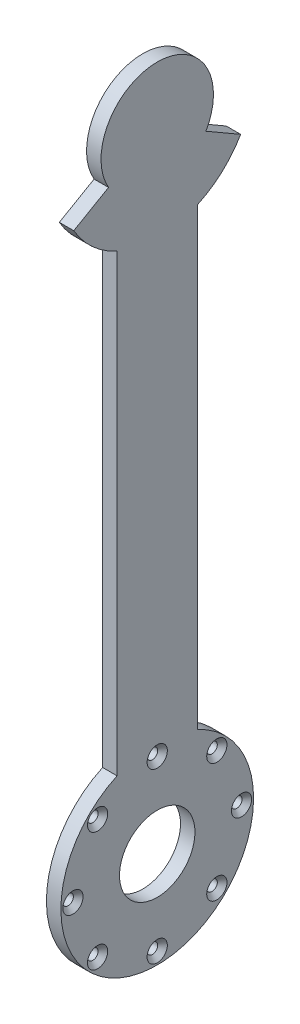
ISO-10303-21;
HEADER;
FILE_DESCRIPTION(('STEP AP214'),'2;1');
FILE_NAME('part.step','',(''),(''),'','','');
FILE_SCHEMA(('AUTOMOTIVE_DESIGN { 1 0 10303 214 1 1 1 1 }'));
ENDSEC;
DATA;
#1=APPLICATION_CONTEXT('core data for automotive mechanical design processes');
#2=APPLICATION_PROTOCOL_DEFINITION('international standard','automotive_design',2000,#1);
#3=PRODUCT_CONTEXT('',#1,'mechanical');
#4=PRODUCT('Part','Part','',(#3));
#5=PRODUCT_RELATED_PRODUCT_CATEGORY('part','',(#4));
#6=PRODUCT_DEFINITION_FORMATION('','',#4);
#7=PRODUCT_DEFINITION_CONTEXT('part definition',#1,'design');
#8=PRODUCT_DEFINITION('design','',#6,#7);
#9=PRODUCT_DEFINITION_SHAPE('','',#8);
#10=(LENGTH_UNIT() NAMED_UNIT(*) SI_UNIT(.MILLI.,.METRE.));
#11=(NAMED_UNIT(*) PLANE_ANGLE_UNIT() SI_UNIT($,.RADIAN.));
#12=(NAMED_UNIT(*) SI_UNIT($,.STERADIAN.) SOLID_ANGLE_UNIT());
#13=UNCERTAINTY_MEASURE_WITH_UNIT(LENGTH_MEASURE(1.E-05),#10,'distance_accuracy_value','');
#14=(GEOMETRIC_REPRESENTATION_CONTEXT(3) GLOBAL_UNCERTAINTY_ASSIGNED_CONTEXT((#13)) GLOBAL_UNIT_ASSIGNED_CONTEXT((#10,
#11,#12)) REPRESENTATION_CONTEXT('',''));
#15=CARTESIAN_POINT('',(0.,0.,0.));
#16=DIRECTION('',(0.,0.,1.));
#17=DIRECTION('',(1.,0.,0.));
#18=AXIS2_PLACEMENT_3D('',#15,#16,#17);
#19=CARTESIAN_POINT('',(9.,196.,0.));
#20=DIRECTION('',(1.,0.,0.));
#21=DIRECTION('',(0.,0.,-1.));
#22=AXIS2_PLACEMENT_3D('',#19,#20,#21);
#23=PLANE('',#22);
#24=CARTESIAN_POINT('',(9.,-143.5,0.));
#25=DIRECTION('',(1.,0.,0.));
#26=DIRECTION('',(0.,0.,-1.));
#27=AXIS2_PLACEMENT_3D('',#24,#25,#26);
#28=CIRCLE('',#27,6.3);
#29=CARTESIAN_POINT('',(9.,-143.5,-6.3));
#30=VERTEX_POINT('',#29);
#31=EDGE_CURVE('E430',#30,#30,#28,.T.);
#32=ORIENTED_EDGE('',*,*,#31,.F.);
#33=EDGE_LOOP('',(#32));
#34=FACE_BOUND('',#33,.T.);
#35=CARTESIAN_POINT('',(9.,-158.876893987705,-37.1231060122945));
#36=DIRECTION('',(1.,0.,0.));
#37=DIRECTION('',(0.,0.,-1.));
#38=AXIS2_PLACEMENT_3D('',#35,#36,#37);
#39=CIRCLE('',#38,6.3);
#40=CARTESIAN_POINT('',(9.,-158.876893987705,-43.4231060122945));
#41=VERTEX_POINT('',#40);
#42=EDGE_CURVE('E412',#41,#41,#39,.T.);
#43=ORIENTED_EDGE('',*,*,#42,.F.);
#44=EDGE_LOOP('',(#43));
#45=FACE_BOUND('',#44,.T.);
#46=CARTESIAN_POINT('',(9.,-196.,-52.5));
#47=DIRECTION('',(1.,0.,0.));
#48=DIRECTION('',(0.,0.,-1.));
#49=AXIS2_PLACEMENT_3D('',#46,#47,#48);
#50=CIRCLE('',#49,6.3);
#51=CARTESIAN_POINT('',(9.,-196.,-58.8));
#52=VERTEX_POINT('',#51);
#53=EDGE_CURVE('E394',#52,#52,#50,.T.);
#54=ORIENTED_EDGE('',*,*,#53,.F.);
#55=EDGE_LOOP('',(#54));
#56=FACE_BOUND('',#55,.T.);
#57=CARTESIAN_POINT('',(9.,-233.123106012294,-37.1231060122938));
#58=DIRECTION('',(1.,0.,0.));
#59=DIRECTION('',(0.,0.,-1.));
#60=AXIS2_PLACEMENT_3D('',#57,#58,#59);
#61=CIRCLE('',#60,6.3);
#62=CARTESIAN_POINT('',(9.,-233.123106012294,-43.4231060122938));
#63=VERTEX_POINT('',#62);
#64=EDGE_CURVE('E376',#63,#63,#61,.T.);
#65=ORIENTED_EDGE('',*,*,#64,.F.);
#66=EDGE_LOOP('',(#65));
#67=FACE_BOUND('',#66,.T.);
#68=CARTESIAN_POINT('',(9.,-248.5,0.));
#69=DIRECTION('',(1.,0.,0.));
#70=DIRECTION('',(0.,0.,-1.));
#71=AXIS2_PLACEMENT_3D('',#68,#69,#70);
#72=CIRCLE('',#71,6.3);
#73=CARTESIAN_POINT('',(9.,-248.5,-6.30000000000006));
#74=VERTEX_POINT('',#73);
#75=EDGE_CURVE('E358',#74,#74,#72,.T.);
#76=ORIENTED_EDGE('',*,*,#75,.F.);
#77=EDGE_LOOP('',(#76));
#78=FACE_BOUND('',#77,.T.);
#79=CARTESIAN_POINT('',(9.,-233.123106012294,37.1231060122937));
#80=DIRECTION('',(1.,0.,0.));
#81=DIRECTION('',(0.,0.,-1.));
#82=AXIS2_PLACEMENT_3D('',#79,#80,#81);
#83=CIRCLE('',#82,6.3);
#84=CARTESIAN_POINT('',(9.,-233.123106012294,30.8231060122937));
#85=VERTEX_POINT('',#84);
#86=EDGE_CURVE('E341',#85,#85,#83,.T.);
#87=ORIENTED_EDGE('',*,*,#86,.F.);
#88=EDGE_LOOP('',(#87));
#89=FACE_BOUND('',#88,.T.);
#90=CARTESIAN_POINT('',(9.,-196.000000000002,52.4999999999978));
#91=DIRECTION('',(1.,0.,0.));
#92=DIRECTION('',(0.,0.,-1.));
#93=AXIS2_PLACEMENT_3D('',#90,#91,#92);
#94=CIRCLE('',#93,6.3);
#95=CARTESIAN_POINT('',(9.,-196.000000000002,46.1999999999978));
#96=VERTEX_POINT('',#95);
#97=EDGE_CURVE('E227',#96,#96,#94,.T.);
#98=ORIENTED_EDGE('',*,*,#97,.F.);
#99=EDGE_LOOP('',(#98));
#100=FACE_BOUND('',#99,.T.);
#101=CARTESIAN_POINT('',(9.,-158.876893987707,37.1231060122927));
#102=DIRECTION('',(1.,0.,0.));
#103=DIRECTION('',(0.,0.,-1.));
#104=AXIS2_PLACEMENT_3D('',#101,#102,#103);
#105=CIRCLE('',#104,6.3);
#106=CARTESIAN_POINT('',(9.,-158.876893987707,30.8231060122927));
#107=VERTEX_POINT('',#106);
#108=EDGE_CURVE('E208',#107,#107,#105,.T.);
#109=ORIENTED_EDGE('',*,*,#108,.F.);
#110=EDGE_LOOP('',(#109));
#111=FACE_BOUND('',#110,.T.);
#112=CARTESIAN_POINT('',(9.,196.,0.));
#113=DIRECTION('',(1.,0.,0.));
#114=DIRECTION('',(0.,0.,-1.));
#115=AXIS2_PLACEMENT_3D('',#112,#113,#114);
#116=CIRCLE('',#115,35.);
#117=CARTESIAN_POINT('',(9.,178.5,-30.3108891324553));
#118=VERTEX_POINT('',#117);
#119=CARTESIAN_POINT('',(9.,178.5,30.3108891324555));
#120=VERTEX_POINT('',#119);
#121=EDGE_CURVE('E170',#118,#120,#116,.T.);
#122=ORIENTED_EDGE('',*,*,#121,.T.);
#123=DIRECTION('',(0.,-0.499999999999995,0.866025403784442));
#124=VECTOR('',#123,1.);
#125=CARTESIAN_POINT('',(9.,178.5,30.3108891324555));
#126=LINE('',#125,#124);
#127=CARTESIAN_POINT('',(9.,166.,51.9615242270665));
#128=VERTEX_POINT('',#127);
#129=EDGE_CURVE('E113',#120,#128,#126,.T.);
#130=ORIENTED_EDGE('',*,*,#129,.T.);
#131=CARTESIAN_POINT('',(9.,196.,0.));
#132=DIRECTION('',(1.,0.,0.));
#133=DIRECTION('',(0.,0.,-1.));
#134=AXIS2_PLACEMENT_3D('',#131,#132,#133);
#135=CIRCLE('',#134,60.);
#136=CARTESIAN_POINT('',(9.,141.456439426821,25.));
#137=VERTEX_POINT('',#136);
#138=EDGE_CURVE('E169',#128,#137,#135,.T.);
#139=ORIENTED_EDGE('',*,*,#138,.T.);
#140=DIRECTION('',(0.,-1.,0.));
#141=VECTOR('',#140,1.);
#142=CARTESIAN_POINT('',(9.,141.456439426821,25.));
#143=LINE('',#142,#141);
#144=CARTESIAN_POINT('',(9.,-141.456439426821,25.));
#145=VERTEX_POINT('',#144);
#146=EDGE_CURVE('E175',#137,#145,#143,.T.);
#147=ORIENTED_EDGE('',*,*,#146,.T.);
#148=CARTESIAN_POINT('',(9.,-196.,0.));
#149=DIRECTION('',(1.,0.,0.));
#150=DIRECTION('',(0.,0.,-1.));
#151=AXIS2_PLACEMENT_3D('',#148,#149,#150);
#152=CIRCLE('',#151,60.);
#153=CARTESIAN_POINT('',(9.,-141.456439426821,-25.));
#154=VERTEX_POINT('',#153);
#155=EDGE_CURVE('E132',#145,#154,#152,.T.);
#156=ORIENTED_EDGE('',*,*,#155,.T.);
#157=DIRECTION('',(0.,1.,0.));
#158=VECTOR('',#157,1.);
#159=CARTESIAN_POINT('',(9.,141.456439426821,-25.));
#160=LINE('',#159,#158);
#161=CARTESIAN_POINT('',(9.,141.456439426822,-25.));
#162=VERTEX_POINT('',#161);
#163=EDGE_CURVE('E126',#154,#162,#160,.T.);
#164=ORIENTED_EDGE('',*,*,#163,.T.);
#165=CARTESIAN_POINT('',(9.,196.,0.));
#166=DIRECTION('',(1.,0.,0.));
#167=DIRECTION('',(0.,0.,-1.));
#168=AXIS2_PLACEMENT_3D('',#165,#166,#167);
#169=CIRCLE('',#168,59.9999999999999);
#170=CARTESIAN_POINT('',(9.,166.,-51.9615242270662));
#171=VERTEX_POINT('',#170);
#172=EDGE_CURVE('E130',#162,#171,#169,.T.);
#173=ORIENTED_EDGE('',*,*,#172,.T.);
#174=DIRECTION('',(0.,0.500000000000002,0.866025403784438));
#175=VECTOR('',#174,1.);
#176=CARTESIAN_POINT('',(9.,178.5,-30.3108891324553));
#177=LINE('',#176,#175);
#178=EDGE_CURVE('E70',#171,#118,#177,.T.);
#179=ORIENTED_EDGE('',*,*,#178,.T.);
#180=EDGE_LOOP('',(#122,#130,#139,#147,#156,#164,#173,#179));
#181=FACE_BOUND('',#180,.T.);
#182=CARTESIAN_POINT('',(9.,-196.,0.));
#183=DIRECTION('',(1.,0.,0.));
#184=DIRECTION('',(0.,0.,-1.));
#185=AXIS2_PLACEMENT_3D('',#182,#183,#184);
#186=CIRCLE('',#185,23.5);
#187=CARTESIAN_POINT('',(9.,-196.,-23.5));
#188=VERTEX_POINT('',#187);
#189=EDGE_CURVE('E185',#188,#188,#186,.T.);
#190=ORIENTED_EDGE('',*,*,#189,.F.);
#191=EDGE_LOOP('',(#190));
#192=FACE_BOUND('',#191,.T.);
#193=ADVANCED_FACE('F52',(#34,#45,#56,#67,#78,#89,#100,#111,#181,#192),#23,.T.);
#194=CARTESIAN_POINT('',(0.,196.,0.));
#195=DIRECTION('',(1.,0.,0.));
#196=DIRECTION('',(0.,0.,-1.));
#197=AXIS2_PLACEMENT_3D('',#194,#195,#196);
#198=PLANE('',#197);
#199=CARTESIAN_POINT('',(0.,-143.5,0.));
#200=DIRECTION('',(1.,0.,0.));
#201=DIRECTION('',(0.,0.,-1.));
#202=AXIS2_PLACEMENT_3D('',#199,#200,#201);
#203=CIRCLE('',#202,3.3);
#204=CARTESIAN_POINT('',(0.,-143.5,-3.3));
#205=VERTEX_POINT('',#204);
#206=EDGE_CURVE('E418',#205,#205,#203,.T.);
#207=ORIENTED_EDGE('',*,*,#206,.T.);
#208=EDGE_LOOP('',(#207));
#209=FACE_BOUND('',#208,.T.);
#210=CARTESIAN_POINT('',(0.,-158.876893987705,-37.1231060122945));
#211=DIRECTION('',(1.,0.,0.));
#212=DIRECTION('',(0.,0.,-1.));
#213=AXIS2_PLACEMENT_3D('',#210,#211,#212);
#214=CIRCLE('',#213,3.3);
#215=CARTESIAN_POINT('',(0.,-158.876893987705,-40.4231060122945));
#216=VERTEX_POINT('',#215);
#217=EDGE_CURVE('E400',#216,#216,#214,.T.);
#218=ORIENTED_EDGE('',*,*,#217,.T.);
#219=EDGE_LOOP('',(#218));
#220=FACE_BOUND('',#219,.T.);
#221=CARTESIAN_POINT('',(0.,-196.,-52.5));
#222=DIRECTION('',(1.,0.,0.));
#223=DIRECTION('',(0.,0.,-1.));
#224=AXIS2_PLACEMENT_3D('',#221,#222,#223);
#225=CIRCLE('',#224,3.3);
#226=CARTESIAN_POINT('',(0.,-196.,-55.8));
#227=VERTEX_POINT('',#226);
#228=EDGE_CURVE('E382',#227,#227,#225,.T.);
#229=ORIENTED_EDGE('',*,*,#228,.T.);
#230=EDGE_LOOP('',(#229));
#231=FACE_BOUND('',#230,.T.);
#232=CARTESIAN_POINT('',(0.,-233.123106012294,-37.1231060122938));
#233=DIRECTION('',(1.,0.,0.));
#234=DIRECTION('',(0.,0.,-1.));
#235=AXIS2_PLACEMENT_3D('',#232,#233,#234);
#236=CIRCLE('',#235,3.3);
#237=CARTESIAN_POINT('',(0.,-233.123106012294,-40.4231060122938));
#238=VERTEX_POINT('',#237);
#239=EDGE_CURVE('E364',#238,#238,#236,.T.);
#240=ORIENTED_EDGE('',*,*,#239,.T.);
#241=EDGE_LOOP('',(#240));
#242=FACE_BOUND('',#241,.T.);
#243=CARTESIAN_POINT('',(0.,-248.5,0.));
#244=DIRECTION('',(1.,0.,0.));
#245=DIRECTION('',(0.,0.,-1.));
#246=AXIS2_PLACEMENT_3D('',#243,#244,#245);
#247=CIRCLE('',#246,3.3);
#248=CARTESIAN_POINT('',(0.,-248.5,-3.30000000000006));
#249=VERTEX_POINT('',#248);
#250=EDGE_CURVE('E346',#249,#249,#247,.T.);
#251=ORIENTED_EDGE('',*,*,#250,.T.);
#252=EDGE_LOOP('',(#251));
#253=FACE_BOUND('',#252,.T.);
#254=CARTESIAN_POINT('',(0.,-233.123106012294,37.1231060122937));
#255=DIRECTION('',(1.,0.,0.));
#256=DIRECTION('',(0.,0.,-1.));
#257=AXIS2_PLACEMENT_3D('',#254,#255,#256);
#258=CIRCLE('',#257,3.3);
#259=CARTESIAN_POINT('',(0.,-233.123106012294,33.8231060122937));
#260=VERTEX_POINT('',#259);
#261=EDGE_CURVE('E233',#260,#260,#258,.T.);
#262=ORIENTED_EDGE('',*,*,#261,.T.);
#263=EDGE_LOOP('',(#262));
#264=FACE_BOUND('',#263,.T.);
#265=CARTESIAN_POINT('',(0.,-196.000000000002,52.4999999999978));
#266=DIRECTION('',(1.,0.,0.));
#267=DIRECTION('',(0.,0.,-1.));
#268=AXIS2_PLACEMENT_3D('',#265,#266,#267);
#269=CIRCLE('',#268,3.3);
#270=CARTESIAN_POINT('',(0.,-196.000000000002,49.1999999999978));
#271=VERTEX_POINT('',#270);
#272=EDGE_CURVE('E214',#271,#271,#269,.T.);
#273=ORIENTED_EDGE('',*,*,#272,.T.);
#274=EDGE_LOOP('',(#273));
#275=FACE_BOUND('',#274,.T.);
#276=CARTESIAN_POINT('',(0.,-158.876893987707,37.1231060122927));
#277=DIRECTION('',(1.,0.,0.));
#278=DIRECTION('',(0.,0.,-1.));
#279=AXIS2_PLACEMENT_3D('',#276,#277,#278);
#280=CIRCLE('',#279,3.3);
#281=CARTESIAN_POINT('',(0.,-158.876893987707,33.8231060122927));
#282=VERTEX_POINT('',#281);
#283=EDGE_CURVE('E192',#282,#282,#280,.T.);
#284=ORIENTED_EDGE('',*,*,#283,.T.);
#285=EDGE_LOOP('',(#284));
#286=FACE_BOUND('',#285,.T.);
#287=CARTESIAN_POINT('',(0.,196.,0.));
#288=DIRECTION('',(1.,0.,0.));
#289=DIRECTION('',(0.,0.,-1.));
#290=AXIS2_PLACEMENT_3D('',#287,#288,#289);
#291=CIRCLE('',#290,35.);
#292=CARTESIAN_POINT('',(0.,178.5,-30.3108891324553));
#293=VERTEX_POINT('',#292);
#294=CARTESIAN_POINT('',(0.,178.5,30.3108891324555));
#295=VERTEX_POINT('',#294);
#296=EDGE_CURVE('E190',#293,#295,#291,.T.);
#297=ORIENTED_EDGE('',*,*,#296,.F.);
#298=DIRECTION('',(0.,0.500000000000002,0.866025403784438));
#299=VECTOR('',#298,1.);
#300=CARTESIAN_POINT('',(0.,178.5,-30.3108891324553));
#301=LINE('',#300,#299);
#302=CARTESIAN_POINT('',(0.,166.,-51.9615242270662));
#303=VERTEX_POINT('',#302);
#304=EDGE_CURVE('E105',#303,#293,#301,.T.);
#305=ORIENTED_EDGE('',*,*,#304,.F.);
#306=CARTESIAN_POINT('',(0.,196.,0.));
#307=DIRECTION('',(1.,0.,0.));
#308=DIRECTION('',(0.,0.,-1.));
#309=AXIS2_PLACEMENT_3D('',#306,#307,#308);
#310=CIRCLE('',#309,59.9999999999999);
#311=CARTESIAN_POINT('',(0.,141.456439426822,-25.));
#312=VERTEX_POINT('',#311);
#313=EDGE_CURVE('E99',#312,#303,#310,.T.);
#314=ORIENTED_EDGE('',*,*,#313,.F.);
#315=DIRECTION('',(0.,1.,0.));
#316=VECTOR('',#315,1.);
#317=CARTESIAN_POINT('',(0.,141.456439426821,-25.));
#318=LINE('',#317,#316);
#319=CARTESIAN_POINT('',(0.,-141.456439426821,-25.));
#320=VERTEX_POINT('',#319);
#321=EDGE_CURVE('E141',#320,#312,#318,.T.);
#322=ORIENTED_EDGE('',*,*,#321,.F.);
#323=CARTESIAN_POINT('',(0.,-196.,0.));
#324=DIRECTION('',(1.,0.,0.));
#325=DIRECTION('',(0.,0.,-1.));
#326=AXIS2_PLACEMENT_3D('',#323,#324,#325);
#327=CIRCLE('',#326,60.);
#328=CARTESIAN_POINT('',(0.,-141.456439426821,25.));
#329=VERTEX_POINT('',#328);
#330=EDGE_CURVE('E246',#329,#320,#327,.T.);
#331=ORIENTED_EDGE('',*,*,#330,.F.);
#332=DIRECTION('',(0.,-1.,0.));
#333=VECTOR('',#332,1.);
#334=CARTESIAN_POINT('',(0.,141.456439426821,25.));
#335=LINE('',#334,#333);
#336=CARTESIAN_POINT('',(0.,141.456439426821,25.));
#337=VERTEX_POINT('',#336);
#338=EDGE_CURVE('E249',#337,#329,#335,.T.);
#339=ORIENTED_EDGE('',*,*,#338,.F.);
#340=CARTESIAN_POINT('',(0.,196.,0.));
#341=DIRECTION('',(1.,0.,0.));
#342=DIRECTION('',(0.,0.,-1.));
#343=AXIS2_PLACEMENT_3D('',#340,#341,#342);
#344=CIRCLE('',#343,60.);
#345=CARTESIAN_POINT('',(0.,166.,51.9615242270665));
#346=VERTEX_POINT('',#345);
#347=EDGE_CURVE('E260',#346,#337,#344,.T.);
#348=ORIENTED_EDGE('',*,*,#347,.F.);
#349=DIRECTION('',(0.,-0.499999999999995,0.866025403784442));
#350=VECTOR('',#349,1.);
#351=CARTESIAN_POINT('',(0.,178.5,30.3108891324555));
#352=LINE('',#351,#350);
#353=EDGE_CURVE('E257',#295,#346,#352,.T.);
#354=ORIENTED_EDGE('',*,*,#353,.F.);
#355=EDGE_LOOP('',(#297,#305,#314,#322,#331,#339,#348,#354));
#356=FACE_BOUND('',#355,.T.);
#357=CARTESIAN_POINT('',(0.,-196.,0.));
#358=DIRECTION('',(1.,0.,0.));
#359=DIRECTION('',(0.,0.,-1.));
#360=AXIS2_PLACEMENT_3D('',#357,#358,#359);
#361=CIRCLE('',#360,23.5);
#362=CARTESIAN_POINT('',(0.,-196.,-23.5));
#363=VERTEX_POINT('',#362);
#364=EDGE_CURVE('E191',#363,#363,#361,.T.);
#365=ORIENTED_EDGE('',*,*,#364,.T.);
#366=EDGE_LOOP('',(#365));
#367=FACE_BOUND('',#366,.T.);
#368=ADVANCED_FACE('F286',(#209,#220,#231,#242,#253,#264,#275,#286,#356,#367),#198,.F.);
#369=CARTESIAN_POINT('',(9.,196.,0.));
#370=DIRECTION('',(-1.,0.,0.));
#371=DIRECTION('',(0.,0.,1.));
#372=AXIS2_PLACEMENT_3D('',#369,#370,#371);
#373=CYLINDRICAL_SURFACE('',#372,35.);
#374=ORIENTED_EDGE('',*,*,#296,.T.);
#375=DIRECTION('',(-1.,0.,0.));
#376=VECTOR('',#375,1.);
#377=CARTESIAN_POINT('',(9.,178.5,30.3108891324555));
#378=LINE('',#377,#376);
#379=EDGE_CURVE('E12',#120,#295,#378,.T.);
#380=ORIENTED_EDGE('',*,*,#379,.F.);
#381=ORIENTED_EDGE('',*,*,#121,.F.);
#382=DIRECTION('',(-1.,0.,0.));
#383=VECTOR('',#382,1.);
#384=CARTESIAN_POINT('',(9.,178.5,-30.3108891324553));
#385=LINE('',#384,#383);
#386=EDGE_CURVE('E151',#118,#293,#385,.T.);
#387=ORIENTED_EDGE('',*,*,#386,.T.);
#388=EDGE_LOOP('',(#374,#380,#381,#387));
#389=FACE_BOUND('',#388,.T.);
#390=ADVANCED_FACE('F54',(#389),#373,.T.);
#391=CARTESIAN_POINT('',(9.,178.5,30.3108891324555));
#392=DIRECTION('',(0.,-0.866025403784442,-0.499999999999995));
#393=DIRECTION('',(0.,0.499999999999995,-0.866025403784442));
#394=AXIS2_PLACEMENT_3D('',#391,#392,#393);
#395=PLANE('',#394);
#396=ORIENTED_EDGE('',*,*,#353,.T.);
#397=DIRECTION('',(-1.,0.,0.));
#398=VECTOR('',#397,1.);
#399=CARTESIAN_POINT('',(9.,166.,51.9615242270665));
#400=LINE('',#399,#398);
#401=EDGE_CURVE('E62',#128,#346,#400,.T.);
#402=ORIENTED_EDGE('',*,*,#401,.F.);
#403=ORIENTED_EDGE('',*,*,#129,.F.);
#404=ORIENTED_EDGE('',*,*,#379,.T.);
#405=EDGE_LOOP('',(#396,#402,#403,#404));
#406=FACE_BOUND('',#405,.T.);
#407=ADVANCED_FACE('F311',(#406),#395,.F.);
#408=CARTESIAN_POINT('',(9.,196.,0.));
#409=DIRECTION('',(-1.,0.,0.));
#410=DIRECTION('',(0.,0.,1.));
#411=AXIS2_PLACEMENT_3D('',#408,#409,#410);
#412=CYLINDRICAL_SURFACE('',#411,60.);
#413=ORIENTED_EDGE('',*,*,#347,.T.);
#414=DIRECTION('',(-1.,0.,0.));
#415=VECTOR('',#414,1.);
#416=CARTESIAN_POINT('',(9.,141.456439426821,25.));
#417=LINE('',#416,#415);
#418=EDGE_CURVE('E278',#137,#337,#417,.T.);
#419=ORIENTED_EDGE('',*,*,#418,.F.);
#420=ORIENTED_EDGE('',*,*,#138,.F.);
#421=ORIENTED_EDGE('',*,*,#401,.T.);
#422=EDGE_LOOP('',(#413,#419,#420,#421));
#423=FACE_BOUND('',#422,.T.);
#424=ADVANCED_FACE('F308',(#423),#412,.T.);
#425=CARTESIAN_POINT('',(9.,141.456439426821,25.));
#426=DIRECTION('',(0.,0.,-1.));
#427=DIRECTION('',(-1.,0.,0.));
#428=AXIS2_PLACEMENT_3D('',#425,#426,#427);
#429=PLANE('',#428);
#430=ORIENTED_EDGE('',*,*,#338,.T.);
#431=DIRECTION('',(-1.,0.,0.));
#432=VECTOR('',#431,1.);
#433=CARTESIAN_POINT('',(9.,-141.456439426821,25.));
#434=LINE('',#433,#432);
#435=EDGE_CURVE('E277',#145,#329,#434,.T.);
#436=ORIENTED_EDGE('',*,*,#435,.F.);
#437=ORIENTED_EDGE('',*,*,#146,.F.);
#438=ORIENTED_EDGE('',*,*,#418,.T.);
#439=EDGE_LOOP('',(#430,#436,#437,#438));
#440=FACE_BOUND('',#439,.T.);
#441=ADVANCED_FACE('F275',(#440),#429,.F.);
#442=CARTESIAN_POINT('',(9.,-196.,0.));
#443=DIRECTION('',(-1.,0.,0.));
#444=DIRECTION('',(0.,0.,1.));
#445=AXIS2_PLACEMENT_3D('',#442,#443,#444);
#446=CYLINDRICAL_SURFACE('',#445,60.);
#447=ORIENTED_EDGE('',*,*,#330,.T.);
#448=DIRECTION('',(-1.,0.,0.));
#449=VECTOR('',#448,1.);
#450=CARTESIAN_POINT('',(9.,-141.456439426821,-25.));
#451=LINE('',#450,#449);
#452=EDGE_CURVE('E143',#154,#320,#451,.T.);
#453=ORIENTED_EDGE('',*,*,#452,.F.);
#454=ORIENTED_EDGE('',*,*,#155,.F.);
#455=ORIENTED_EDGE('',*,*,#435,.T.);
#456=EDGE_LOOP('',(#447,#453,#454,#455));
#457=FACE_BOUND('',#456,.T.);
#458=ADVANCED_FACE('F282',(#457),#446,.T.);
#459=CARTESIAN_POINT('',(9.,141.456439426821,-25.));
#460=DIRECTION('',(0.,0.,1.));
#461=DIRECTION('',(1.,0.,0.));
#462=AXIS2_PLACEMENT_3D('',#459,#460,#461);
#463=PLANE('',#462);
#464=ORIENTED_EDGE('',*,*,#321,.T.);
#465=DIRECTION('',(-1.,0.,0.));
#466=VECTOR('',#465,1.);
#467=CARTESIAN_POINT('',(9.,141.456439426822,-25.));
#468=LINE('',#467,#466);
#469=EDGE_CURVE('E138',#162,#312,#468,.T.);
#470=ORIENTED_EDGE('',*,*,#469,.F.);
#471=ORIENTED_EDGE('',*,*,#163,.F.);
#472=ORIENTED_EDGE('',*,*,#452,.T.);
#473=EDGE_LOOP('',(#464,#470,#471,#472));
#474=FACE_BOUND('',#473,.T.);
#475=ADVANCED_FACE('F139',(#474),#463,.F.);
#476=CARTESIAN_POINT('',(9.,196.,0.));
#477=DIRECTION('',(-1.,0.,0.));
#478=DIRECTION('',(0.,0.,1.));
#479=AXIS2_PLACEMENT_3D('',#476,#477,#478);
#480=CYLINDRICAL_SURFACE('',#479,59.9999999999999);
#481=ORIENTED_EDGE('',*,*,#313,.T.);
#482=DIRECTION('',(-1.,0.,0.));
#483=VECTOR('',#482,1.);
#484=CARTESIAN_POINT('',(9.,166.,-51.9615242270662));
#485=LINE('',#484,#483);
#486=EDGE_CURVE('E144',#171,#303,#485,.T.);
#487=ORIENTED_EDGE('',*,*,#486,.F.);
#488=ORIENTED_EDGE('',*,*,#172,.F.);
#489=ORIENTED_EDGE('',*,*,#469,.T.);
#490=EDGE_LOOP('',(#481,#487,#488,#489));
#491=FACE_BOUND('',#490,.T.);
#492=ADVANCED_FACE('F146',(#491),#480,.T.);
#493=CARTESIAN_POINT('',(9.,178.5,-30.3108891324553));
#494=DIRECTION('',(0.,-0.866025403784437,0.500000000000002));
#495=DIRECTION('',(0.,-0.500000000000002,-0.866025403784438));
#496=AXIS2_PLACEMENT_3D('',#493,#494,#495);
#497=PLANE('',#496);
#498=ORIENTED_EDGE('',*,*,#304,.T.);
#499=ORIENTED_EDGE('',*,*,#386,.F.);
#500=ORIENTED_EDGE('',*,*,#178,.F.);
#501=ORIENTED_EDGE('',*,*,#486,.T.);
#502=EDGE_LOOP('',(#498,#499,#500,#501));
#503=FACE_BOUND('',#502,.T.);
#504=ADVANCED_FACE('F498',(#503),#497,.F.);
#505=CARTESIAN_POINT('',(9.,-196.,0.));
#506=DIRECTION('',(-1.,0.,0.));
#507=DIRECTION('',(0.,0.,1.));
#508=AXIS2_PLACEMENT_3D('',#505,#506,#507);
#509=CYLINDRICAL_SURFACE('',#508,23.5);
#510=ORIENTED_EDGE('',*,*,#189,.T.);
#511=EDGE_LOOP('',(#510));
#512=FACE_BOUND('',#511,.T.);
#513=ORIENTED_EDGE('',*,*,#364,.F.);
#514=EDGE_LOOP('',(#513));
#515=FACE_BOUND('',#514,.T.);
#516=ADVANCED_FACE('F492',(#512,#515),#509,.F.);
#517=CARTESIAN_POINT('',(9.,-158.876893987707,37.1231060122927));
#518=DIRECTION('',(1.,0.,0.));
#519=DIRECTION('',(0.,0.,-1.));
#520=AXIS2_PLACEMENT_3D('',#517,#518,#519);
#521=CYLINDRICAL_SURFACE('',#520,3.3);
#522=ORIENTED_EDGE('',*,*,#283,.F.);
#523=EDGE_LOOP('',(#522));
#524=FACE_BOUND('',#523,.T.);
#525=CARTESIAN_POINT('',(5.99999999999998,-158.876893987707,37.1231060122927));
#526=DIRECTION('',(1.,0.,0.));
#527=DIRECTION('',(0.,0.,-1.));
#528=AXIS2_PLACEMENT_3D('',#525,#526,#527);
#529=CIRCLE('',#528,3.3);
#530=CARTESIAN_POINT('',(5.99999999999998,-158.876893987707,33.8231060122927));
#531=VERTEX_POINT('',#530);
#532=EDGE_CURVE('E202',#531,#531,#529,.T.);
#533=ORIENTED_EDGE('',*,*,#532,.T.);
#534=EDGE_LOOP('',(#533));
#535=FACE_BOUND('',#534,.T.);
#536=ADVANCED_FACE('F482',(#524,#535),#521,.F.);
#537=CARTESIAN_POINT('',(9.,-158.876893987707,37.1231060122927));
#538=DIRECTION('',(1.,0.,0.));
#539=DIRECTION('',(0.,0.,-1.));
#540=AXIS2_PLACEMENT_3D('',#537,#538,#539);
#541=CONICAL_SURFACE('',#540,6.3,0.785398163397446);
#542=ORIENTED_EDGE('',*,*,#532,.F.);
#543=EDGE_LOOP('',(#542));
#544=FACE_BOUND('',#543,.T.);
#545=ORIENTED_EDGE('',*,*,#108,.T.);
#546=EDGE_LOOP('',(#545));
#547=FACE_BOUND('',#546,.T.);
#548=ADVANCED_FACE('F479',(#544,#547),#541,.F.);
#549=CARTESIAN_POINT('',(9.,-196.000000000002,52.4999999999978));
#550=DIRECTION('',(1.,0.,0.));
#551=DIRECTION('',(0.,0.,-1.));
#552=AXIS2_PLACEMENT_3D('',#549,#550,#551);
#553=CYLINDRICAL_SURFACE('',#552,3.3);
#554=ORIENTED_EDGE('',*,*,#272,.F.);
#555=EDGE_LOOP('',(#554));
#556=FACE_BOUND('',#555,.T.);
#557=CARTESIAN_POINT('',(5.99999999999998,-196.000000000002,52.4999999999978));
#558=DIRECTION('',(1.,0.,0.));
#559=DIRECTION('',(0.,0.,-1.));
#560=AXIS2_PLACEMENT_3D('',#557,#558,#559);
#561=CIRCLE('',#560,3.3);
#562=CARTESIAN_POINT('',(5.99999999999998,-196.000000000002,49.1999999999978));
#563=VERTEX_POINT('',#562);
#564=EDGE_CURVE('E232',#563,#563,#561,.T.);
#565=ORIENTED_EDGE('',*,*,#564,.T.);
#566=EDGE_LOOP('',(#565));
#567=FACE_BOUND('',#566,.T.);
#568=ADVANCED_FACE('F481',(#556,#567),#553,.F.);
#569=CARTESIAN_POINT('',(9.,-196.000000000002,52.4999999999978));
#570=DIRECTION('',(1.,0.,0.));
#571=DIRECTION('',(0.,0.,-1.));
#572=AXIS2_PLACEMENT_3D('',#569,#570,#571);
#573=CONICAL_SURFACE('',#572,6.3,0.785398163397446);
#574=ORIENTED_EDGE('',*,*,#564,.F.);
#575=EDGE_LOOP('',(#574));
#576=FACE_BOUND('',#575,.T.);
#577=ORIENTED_EDGE('',*,*,#97,.T.);
#578=EDGE_LOOP('',(#577));
#579=FACE_BOUND('',#578,.T.);
#580=ADVANCED_FACE('F489',(#576,#579),#573,.F.);
#581=CARTESIAN_POINT('',(9.,-233.123106012294,37.1231060122937));
#582=DIRECTION('',(1.,0.,0.));
#583=DIRECTION('',(0.,0.,-1.));
#584=AXIS2_PLACEMENT_3D('',#581,#582,#583);
#585=CYLINDRICAL_SURFACE('',#584,3.3);
#586=ORIENTED_EDGE('',*,*,#261,.F.);
#587=EDGE_LOOP('',(#586));
#588=FACE_BOUND('',#587,.T.);
#589=CARTESIAN_POINT('',(5.99999999999998,-233.123106012294,37.1231060122937));
#590=DIRECTION('',(1.,0.,0.));
#591=DIRECTION('',(0.,0.,-1.));
#592=AXIS2_PLACEMENT_3D('',#589,#590,#591);
#593=CIRCLE('',#592,3.3);
#594=CARTESIAN_POINT('',(5.99999999999998,-233.123106012294,33.8231060122937));
#595=VERTEX_POINT('',#594);
#596=EDGE_CURVE('E336',#595,#595,#593,.T.);
#597=ORIENTED_EDGE('',*,*,#596,.T.);
#598=EDGE_LOOP('',(#597));
#599=FACE_BOUND('',#598,.T.);
#600=ADVANCED_FACE('F598',(#588,#599),#585,.F.);
#601=CARTESIAN_POINT('',(9.,-233.123106012294,37.1231060122937));
#602=DIRECTION('',(1.,0.,0.));
#603=DIRECTION('',(0.,0.,-1.));
#604=AXIS2_PLACEMENT_3D('',#601,#602,#603);
#605=CONICAL_SURFACE('',#604,6.3,0.785398163397446);
#606=ORIENTED_EDGE('',*,*,#596,.F.);
#607=EDGE_LOOP('',(#606));
#608=FACE_BOUND('',#607,.T.);
#609=ORIENTED_EDGE('',*,*,#86,.T.);
#610=EDGE_LOOP('',(#609));
#611=FACE_BOUND('',#610,.T.);
#612=ADVANCED_FACE('F607',(#608,#611),#605,.F.);
#613=CARTESIAN_POINT('',(9.,-248.5,0.));
#614=DIRECTION('',(1.,0.,0.));
#615=DIRECTION('',(0.,0.,-1.));
#616=AXIS2_PLACEMENT_3D('',#613,#614,#615);
#617=CYLINDRICAL_SURFACE('',#616,3.3);
#618=ORIENTED_EDGE('',*,*,#250,.F.);
#619=EDGE_LOOP('',(#618));
#620=FACE_BOUND('',#619,.T.);
#621=CARTESIAN_POINT('',(5.99999999999998,-248.5,0.));
#622=DIRECTION('',(1.,0.,0.));
#623=DIRECTION('',(0.,0.,-1.));
#624=AXIS2_PLACEMENT_3D('',#621,#622,#623);
#625=CIRCLE('',#624,3.3);
#626=CARTESIAN_POINT('',(5.99999999999998,-248.5,-3.30000000000006));
#627=VERTEX_POINT('',#626);
#628=EDGE_CURVE('E352',#627,#627,#625,.T.);
#629=ORIENTED_EDGE('',*,*,#628,.T.);
#630=EDGE_LOOP('',(#629));
#631=FACE_BOUND('',#630,.T.);
#632=ADVANCED_FACE('F617',(#620,#631),#617,.F.);
#633=CARTESIAN_POINT('',(9.,-248.5,0.));
#634=DIRECTION('',(1.,0.,0.));
#635=DIRECTION('',(0.,0.,-1.));
#636=AXIS2_PLACEMENT_3D('',#633,#634,#635);
#637=CONICAL_SURFACE('',#636,6.3,0.785398163397446);
#638=ORIENTED_EDGE('',*,*,#628,.F.);
#639=EDGE_LOOP('',(#638));
#640=FACE_BOUND('',#639,.T.);
#641=ORIENTED_EDGE('',*,*,#75,.T.);
#642=EDGE_LOOP('',(#641));
#643=FACE_BOUND('',#642,.T.);
#644=ADVANCED_FACE('F627',(#640,#643),#637,.F.);
#645=CARTESIAN_POINT('',(9.,-233.123106012294,-37.1231060122938));
#646=DIRECTION('',(1.,0.,0.));
#647=DIRECTION('',(0.,0.,-1.));
#648=AXIS2_PLACEMENT_3D('',#645,#646,#647);
#649=CYLINDRICAL_SURFACE('',#648,3.3);
#650=ORIENTED_EDGE('',*,*,#239,.F.);
#651=EDGE_LOOP('',(#650));
#652=FACE_BOUND('',#651,.T.);
#653=CARTESIAN_POINT('',(5.99999999999998,-233.123106012294,-37.1231060122938));
#654=DIRECTION('',(1.,0.,0.));
#655=DIRECTION('',(0.,0.,-1.));
#656=AXIS2_PLACEMENT_3D('',#653,#654,#655);
#657=CIRCLE('',#656,3.3);
#658=CARTESIAN_POINT('',(5.99999999999998,-233.123106012294,-40.4231060122938));
#659=VERTEX_POINT('',#658);
#660=EDGE_CURVE('E370',#659,#659,#657,.T.);
#661=ORIENTED_EDGE('',*,*,#660,.T.);
#662=EDGE_LOOP('',(#661));
#663=FACE_BOUND('',#662,.T.);
#664=ADVANCED_FACE('F637',(#652,#663),#649,.F.);
#665=CARTESIAN_POINT('',(9.,-233.123106012294,-37.1231060122938));
#666=DIRECTION('',(1.,0.,0.));
#667=DIRECTION('',(0.,0.,-1.));
#668=AXIS2_PLACEMENT_3D('',#665,#666,#667);
#669=CONICAL_SURFACE('',#668,6.3,0.785398163397446);
#670=ORIENTED_EDGE('',*,*,#660,.F.);
#671=EDGE_LOOP('',(#670));
#672=FACE_BOUND('',#671,.T.);
#673=ORIENTED_EDGE('',*,*,#64,.T.);
#674=EDGE_LOOP('',(#673));
#675=FACE_BOUND('',#674,.T.);
#676=ADVANCED_FACE('F647',(#672,#675),#669,.F.);
#677=CARTESIAN_POINT('',(9.,-196.,-52.5));
#678=DIRECTION('',(1.,0.,0.));
#679=DIRECTION('',(0.,0.,-1.));
#680=AXIS2_PLACEMENT_3D('',#677,#678,#679);
#681=CYLINDRICAL_SURFACE('',#680,3.3);
#682=ORIENTED_EDGE('',*,*,#228,.F.);
#683=EDGE_LOOP('',(#682));
#684=FACE_BOUND('',#683,.T.);
#685=CARTESIAN_POINT('',(5.99999999999998,-196.,-52.5));
#686=DIRECTION('',(1.,0.,0.));
#687=DIRECTION('',(0.,0.,-1.));
#688=AXIS2_PLACEMENT_3D('',#685,#686,#687);
#689=CIRCLE('',#688,3.3);
#690=CARTESIAN_POINT('',(5.99999999999998,-196.,-55.8));
#691=VERTEX_POINT('',#690);
#692=EDGE_CURVE('E388',#691,#691,#689,.T.);
#693=ORIENTED_EDGE('',*,*,#692,.T.);
#694=EDGE_LOOP('',(#693));
#695=FACE_BOUND('',#694,.T.);
#696=ADVANCED_FACE('F657',(#684,#695),#681,.F.);
#697=CARTESIAN_POINT('',(9.,-196.,-52.5));
#698=DIRECTION('',(1.,0.,0.));
#699=DIRECTION('',(0.,0.,-1.));
#700=AXIS2_PLACEMENT_3D('',#697,#698,#699);
#701=CONICAL_SURFACE('',#700,6.3,0.785398163397446);
#702=ORIENTED_EDGE('',*,*,#692,.F.);
#703=EDGE_LOOP('',(#702));
#704=FACE_BOUND('',#703,.T.);
#705=ORIENTED_EDGE('',*,*,#53,.T.);
#706=EDGE_LOOP('',(#705));
#707=FACE_BOUND('',#706,.T.);
#708=ADVANCED_FACE('F667',(#704,#707),#701,.F.);
#709=CARTESIAN_POINT('',(9.,-158.876893987705,-37.1231060122945));
#710=DIRECTION('',(1.,0.,0.));
#711=DIRECTION('',(0.,0.,-1.));
#712=AXIS2_PLACEMENT_3D('',#709,#710,#711);
#713=CYLINDRICAL_SURFACE('',#712,3.3);
#714=ORIENTED_EDGE('',*,*,#217,.F.);
#715=EDGE_LOOP('',(#714));
#716=FACE_BOUND('',#715,.T.);
#717=CARTESIAN_POINT('',(5.99999999999998,-158.876893987705,-37.1231060122945));
#718=DIRECTION('',(1.,0.,0.));
#719=DIRECTION('',(0.,0.,-1.));
#720=AXIS2_PLACEMENT_3D('',#717,#718,#719);
#721=CIRCLE('',#720,3.3);
#722=CARTESIAN_POINT('',(5.99999999999998,-158.876893987705,-40.4231060122945));
#723=VERTEX_POINT('',#722);
#724=EDGE_CURVE('E406',#723,#723,#721,.T.);
#725=ORIENTED_EDGE('',*,*,#724,.T.);
#726=EDGE_LOOP('',(#725));
#727=FACE_BOUND('',#726,.T.);
#728=ADVANCED_FACE('F677',(#716,#727),#713,.F.);
#729=CARTESIAN_POINT('',(9.,-158.876893987705,-37.1231060122945));
#730=DIRECTION('',(1.,0.,0.));
#731=DIRECTION('',(0.,0.,-1.));
#732=AXIS2_PLACEMENT_3D('',#729,#730,#731);
#733=CONICAL_SURFACE('',#732,6.3,0.785398163397446);
#734=ORIENTED_EDGE('',*,*,#724,.F.);
#735=EDGE_LOOP('',(#734));
#736=FACE_BOUND('',#735,.T.);
#737=ORIENTED_EDGE('',*,*,#42,.T.);
#738=EDGE_LOOP('',(#737));
#739=FACE_BOUND('',#738,.T.);
#740=ADVANCED_FACE('F687',(#736,#739),#733,.F.);
#741=CARTESIAN_POINT('',(9.,-143.5,0.));
#742=DIRECTION('',(1.,0.,0.));
#743=DIRECTION('',(0.,0.,-1.));
#744=AXIS2_PLACEMENT_3D('',#741,#742,#743);
#745=CYLINDRICAL_SURFACE('',#744,3.3);
#746=ORIENTED_EDGE('',*,*,#206,.F.);
#747=EDGE_LOOP('',(#746));
#748=FACE_BOUND('',#747,.T.);
#749=CARTESIAN_POINT('',(5.99999999999998,-143.5,0.));
#750=DIRECTION('',(1.,0.,0.));
#751=DIRECTION('',(0.,0.,-1.));
#752=AXIS2_PLACEMENT_3D('',#749,#750,#751);
#753=CIRCLE('',#752,3.3);
#754=CARTESIAN_POINT('',(5.99999999999998,-143.5,-3.3));
#755=VERTEX_POINT('',#754);
#756=EDGE_CURVE('E424',#755,#755,#753,.T.);
#757=ORIENTED_EDGE('',*,*,#756,.T.);
#758=EDGE_LOOP('',(#757));
#759=FACE_BOUND('',#758,.T.);
#760=ADVANCED_FACE('F697',(#748,#759),#745,.F.);
#761=CARTESIAN_POINT('',(9.,-143.5,0.));
#762=DIRECTION('',(1.,0.,0.));
#763=DIRECTION('',(0.,0.,-1.));
#764=AXIS2_PLACEMENT_3D('',#761,#762,#763);
#765=CONICAL_SURFACE('',#764,6.3,0.785398163397446);
#766=ORIENTED_EDGE('',*,*,#756,.F.);
#767=EDGE_LOOP('',(#766));
#768=FACE_BOUND('',#767,.T.);
#769=ORIENTED_EDGE('',*,*,#31,.T.);
#770=EDGE_LOOP('',(#769));
#771=FACE_BOUND('',#770,.T.);
#772=ADVANCED_FACE('F460',(#768,#771),#765,.F.);
#773=CLOSED_SHELL('',(#193,#368,#390,#407,#424,#441,#458,#475,#492,#504,#516,#536,#548,#568,
#580,#600,#612,#632,#644,#664,#676,#696,#708,#728,#740,#760,#772));
#774=MANIFOLD_SOLID_BREP('B2',#773);
#775=ADVANCED_BREP_SHAPE_REPRESENTATION('',(#18,#774),#14);
#776=SHAPE_DEFINITION_REPRESENTATION(#9,#775);
ENDSEC;
END-ISO-10303-21;
